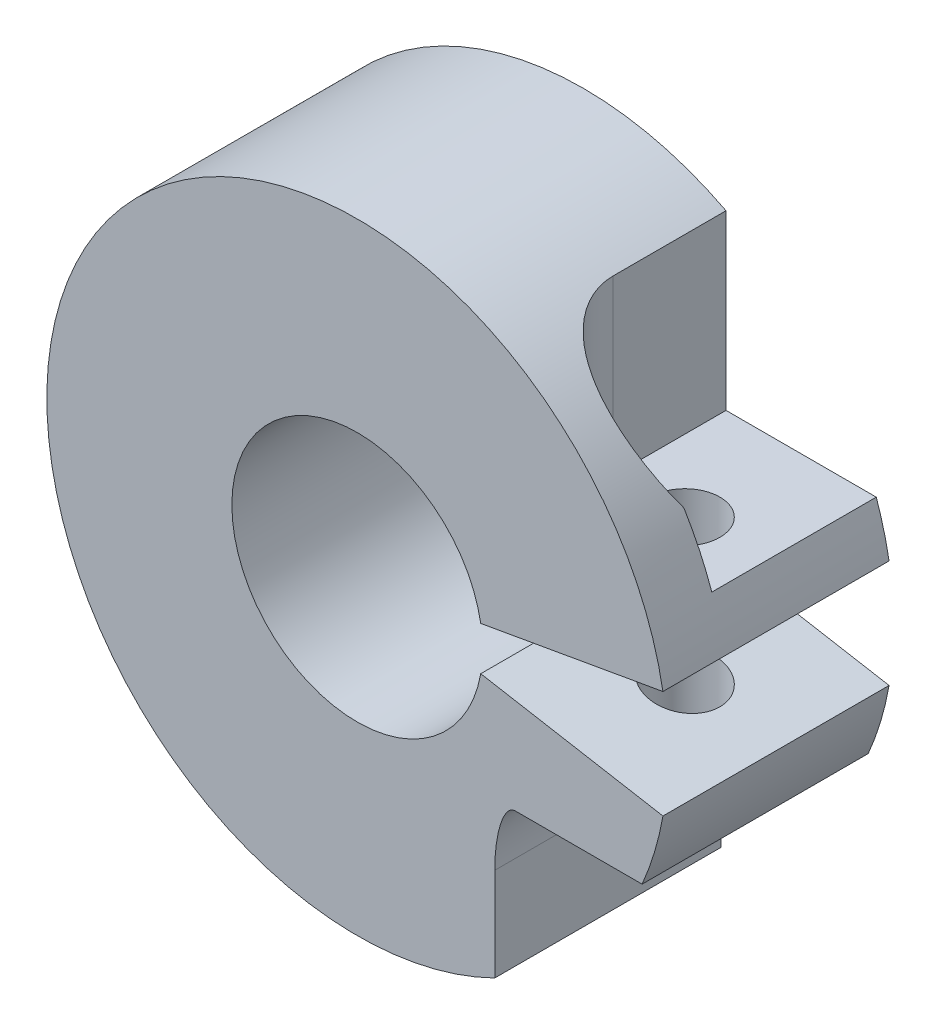
ISO-10303-21;
HEADER;
FILE_DESCRIPTION(('STEP AP214'),'2;1');
FILE_NAME('part.step','',(''),(''),'','','');
FILE_SCHEMA(('AUTOMOTIVE_DESIGN { 1 0 10303 214 1 1 1 1 }'));
ENDSEC;
DATA;
#1=APPLICATION_CONTEXT('core data for automotive mechanical design processes');
#2=APPLICATION_PROTOCOL_DEFINITION('international standard','automotive_design',2000,#1);
#3=PRODUCT_CONTEXT('',#1,'mechanical');
#4=PRODUCT('Part','Part','',(#3));
#5=PRODUCT_RELATED_PRODUCT_CATEGORY('part','',(#4));
#6=PRODUCT_DEFINITION_FORMATION('','',#4);
#7=PRODUCT_DEFINITION_CONTEXT('part definition',#1,'design');
#8=PRODUCT_DEFINITION('design','',#6,#7);
#9=PRODUCT_DEFINITION_SHAPE('','',#8);
#10=(LENGTH_UNIT() NAMED_UNIT(*) SI_UNIT(.MILLI.,.METRE.));
#11=(NAMED_UNIT(*) PLANE_ANGLE_UNIT() SI_UNIT($,.RADIAN.));
#12=(NAMED_UNIT(*) SI_UNIT($,.STERADIAN.) SOLID_ANGLE_UNIT());
#13=UNCERTAINTY_MEASURE_WITH_UNIT(LENGTH_MEASURE(1.E-05),#10,'distance_accuracy_value','');
#14=(GEOMETRIC_REPRESENTATION_CONTEXT(3) GLOBAL_UNCERTAINTY_ASSIGNED_CONTEXT((#13)) GLOBAL_UNIT_ASSIGNED_CONTEXT((#10,
#11,#12)) REPRESENTATION_CONTEXT('',''));
#15=CARTESIAN_POINT('',(0.,0.,0.));
#16=DIRECTION('',(0.,0.,1.));
#17=DIRECTION('',(1.,0.,0.));
#18=AXIS2_PLACEMENT_3D('',#15,#16,#17);
#19=CARTESIAN_POINT('',(0.,0.,11.));
#20=DIRECTION('',(0.,0.,-1.));
#21=DIRECTION('',(-1.,0.,0.));
#22=AXIS2_PLACEMENT_3D('',#19,#20,#21);
#23=CYLINDRICAL_SURFACE('',#22,15.1);
#24=CARTESIAN_POINT('',(0.,0.,0.));
#25=DIRECTION('',(0.,0.,1.));
#26=DIRECTION('',(1.,0.,0.));
#27=AXIS2_PLACEMENT_3D('',#24,#25,#26);
#28=CIRCLE('',#27,15.1);
#29=CARTESIAN_POINT('',(6.9389621819294,13.4112193270319,0.));
#30=VERTEX_POINT('',#29);
#31=CARTESIAN_POINT('',(6.6889621819294,-13.5376432560737,0.));
#32=VERTEX_POINT('',#31);
#33=EDGE_CURVE('E194',#30,#32,#28,.T.);
#34=ORIENTED_EDGE('',*,*,#33,.T.);
#35=DIRECTION('',(0.,0.,-1.));
#36=VECTOR('',#35,1.);
#37=CARTESIAN_POINT('',(6.6889621819294,-13.5376432560737,11.));
#38=LINE('',#37,#36);
#39=CARTESIAN_POINT('',(6.6889621819294,-13.5376432560737,11.));
#40=VERTEX_POINT('',#39);
#41=EDGE_CURVE('E158',#32,#40,#38,.F.);
#42=ORIENTED_EDGE('',*,*,#41,.T.);
#43=CARTESIAN_POINT('',(0.,0.,11.));
#44=DIRECTION('',(0.,0.,1.));
#45=DIRECTION('',(1.,0.,0.));
#46=AXIS2_PLACEMENT_3D('',#43,#44,#45);
#47=CIRCLE('',#46,15.1);
#48=CARTESIAN_POINT('',(14.8705970704843,2.62208748277065,11.));
#49=VERTEX_POINT('',#48);
#50=EDGE_CURVE('E166',#49,#40,#47,.T.);
#51=ORIENTED_EDGE('',*,*,#50,.F.);
#52=DIRECTION('',(0.,0.,-1.));
#53=VECTOR('',#52,1.);
#54=CARTESIAN_POINT('',(14.8705970704843,2.62208748277065,11.));
#55=LINE('',#54,#53);
#56=CARTESIAN_POINT('',(14.8705970704843,2.62208748277065,0.));
#57=VERTEX_POINT('',#56);
#58=EDGE_CURVE('E202',#49,#57,#55,.T.);
#59=ORIENTED_EDGE('',*,*,#58,.T.);
#60=CARTESIAN_POINT('',(14.2481577756565,5.,0.));
#61=VERTEX_POINT('',#60);
#62=EDGE_CURVE('E189',#57,#61,#28,.T.);
#63=ORIENTED_EDGE('',*,*,#62,.T.);
#64=DIRECTION('',(0.,0.,-1.));
#65=VECTOR('',#64,1.);
#66=CARTESIAN_POINT('',(14.2481577756565,5.,11.));
#67=LINE('',#66,#65);
#68=CARTESIAN_POINT('',(14.2481577756565,5.,8.));
#69=VERTEX_POINT('',#68);
#70=EDGE_CURVE('E358',#69,#61,#67,.T.);
#71=ORIENTED_EDGE('',*,*,#70,.F.);
#72=CARTESIAN_POINT('',(0.,0.,8.00000000000001));
#73=DIRECTION('',(0.,0.,1.));
#74=DIRECTION('',(1.,0.,0.));
#75=AXIS2_PLACEMENT_3D('',#72,#73,#74);
#76=CIRCLE('',#75,15.1);
#77=CARTESIAN_POINT('',(12.8884519247126,7.86751593480258,8.));
#78=VERTEX_POINT('',#77);
#79=EDGE_CURVE('E219',#69,#78,#76,.T.);
#80=ORIENTED_EDGE('',*,*,#79,.T.);
#81=CARTESIAN_POINT('',(6.9389621819294,13.4112193270319,5.5));
#82=CARTESIAN_POINT('',(6.9389484513675,13.4112195447243,5.58924999652139));
#83=CARTESIAN_POINT('',(6.9423757267014,13.4094529834948,5.67849416502968));
#84=CARTESIAN_POINT('',(6.95600807768608,13.4023900647413,5.85630821640909));
#85=CARTESIAN_POINT('',(6.96621202045145,13.3970942972097,5.94487820948228));
#86=CARTESIAN_POINT('',(6.99325851560519,13.3829949935007,6.12048401680907));
#87=CARTESIAN_POINT('',(7.01008381882675,13.3742005709519,6.20752320831468));
#88=CARTESIAN_POINT('',(7.05015303315526,13.3531213987343,6.379655732637));
#89=CARTESIAN_POINT('',(7.07339699447195,13.3408366217622,6.46474905022654));
#90=CARTESIAN_POINT('',(7.15237983680038,13.2987618992325,6.71620247749444));
#91=CARTESIAN_POINT('',(7.217396572924,13.2637379852567,6.8789072122984));
#92=CARTESIAN_POINT('',(7.36909464868571,13.1800566331543,7.18994746689632));
#93=CARTESIAN_POINT('',(7.45578011436167,13.1313965983003,7.33828024258971));
#94=CARTESIAN_POINT('',(7.64950465847406,13.0195188355864,7.62109476473803));
#95=CARTESIAN_POINT('',(7.75701309309699,12.9559564417325,7.75511779511494));
#96=CARTESIAN_POINT('',(7.98628566294028,12.8158992203683,8.00257281061084));
#97=CARTESIAN_POINT('',(8.10805481840316,12.7393998343781,8.11599750838199));
#98=CARTESIAN_POINT('',(8.37303946606088,12.5669969804962,8.33084689220787));
#99=CARTESIAN_POINT('',(8.51719663962771,12.4699521523716,8.43018459181593));
#100=CARTESIAN_POINT('',(8.81179268779963,12.2635500033635,8.6034760005425));
#101=CARTESIAN_POINT('',(8.96223465372188,12.154186577351,8.67741704885586));
#102=CARTESIAN_POINT('',(9.22247099039008,11.9572058378946,8.78390295401551));
#103=CARTESIAN_POINT('',(9.33184936319642,11.8720761282391,8.82224176534463));
#104=CARTESIAN_POINT('',(9.55032157621495,11.6970481788694,8.88722678799494));
#105=CARTESIAN_POINT('',(9.65941530759329,11.6071483349366,8.91386903741164));
#106=CARTESIAN_POINT('',(9.87638905374758,11.4231002098596,8.95626298044255));
#107=CARTESIAN_POINT('',(9.98426690124502,11.3289454985226,8.97199756073089));
#108=CARTESIAN_POINT('',(10.1978514212074,11.1370755115648,8.99333473247951));
#109=CARTESIAN_POINT('',(10.3035575216853,11.0393593162641,8.9989346876981));
#110=CARTESIAN_POINT('',(10.5481654856095,10.8066494467967,9.00110894357342));
#111=CARTESIAN_POINT('',(10.6859376947487,10.6704261100018,8.99390268881406));
#112=CARTESIAN_POINT('',(10.9553619363254,10.3936226533899,8.96434839975531));
#113=CARTESIAN_POINT('',(11.0870116290945,10.2530409016929,8.94199462694998));
#114=CARTESIAN_POINT('',(11.3436795460359,9.96833623986629,8.88361269187177));
#115=CARTESIAN_POINT('',(11.4686872825025,9.82420822609415,8.84756359555258));
#116=CARTESIAN_POINT('',(11.7114149803872,9.53355143464644,8.76303221124716));
#117=CARTESIAN_POINT('',(11.8291362833521,9.38702310522724,8.71455222048769));
#118=CARTESIAN_POINT('',(12.03130213163,9.12570879869751,8.6183321173353));
#119=CARTESIAN_POINT('',(12.1172564430532,9.01122975276712,8.57289888213371));
#120=CARTESIAN_POINT('',(12.2845768786763,8.78176129823346,8.47541209381099));
#121=CARTESIAN_POINT('',(12.3659436003598,8.66677195820448,8.4233594056896));
#122=CARTESIAN_POINT('',(12.5235299533566,8.43744118430534,8.31314416888982));
#123=CARTESIAN_POINT('',(12.5997790536668,8.32310028593413,8.25502262520672));
#124=CARTESIAN_POINT('',(12.747624616099,8.09485108471857,8.13234730153382));
#125=CARTESIAN_POINT('',(12.8192207896106,7.98094280912065,8.06779312317036));
#126=CARTESIAN_POINT('',(12.8884519247126,7.86751593480258,8.));
#127=B_SPLINE_CURVE_WITH_KNOTS('',3,(#81,#82,#83,#84,#85,#86,#87,#88,#89,#90,#91,#92,#93,#94,
#95,#96,#97,#98,#99,#100,#101,#102,#103,#104,#105,#106,#107,#108,#109,#110,#111,#112,#113,#114,
#115,#116,#117,#118,#119,#120,#121,#122,#123,#124,#125,#126),.UNSPECIFIED.,.F.,.F.,(4,2,2,2,2,2,
2,2,2,2,2,2,2,2,2,2,2,2,2,2,2,2,4),(0.,0.267656681662357,0.535268629235359,0.802187993021052,
1.06910944483428,1.60243763509126,2.13586745617045,2.68312478259433,3.23057534398822,
3.82877281612181,4.4272680718566,4.85814795147117,5.28917366798336,5.72087411072246,
6.15268683222946,6.73348063515818,7.31449458988881,7.89640025281596,8.47819845710031,
8.92856727821362,9.37887730755463,9.82632065407159,10.2737917280388),.UNSPECIFIED.);
#128=CARTESIAN_POINT('',(6.9389621819294,13.4112193270319,5.5));
#129=VERTEX_POINT('',#128);
#130=EDGE_CURVE('E223',#129,#78,#127,.T.);
#131=ORIENTED_EDGE('',*,*,#130,.F.);
#132=DIRECTION('',(0.,0.,-1.));
#133=VECTOR('',#132,1.);
#134=CARTESIAN_POINT('',(6.9389621819294,13.4112193270319,11.));
#135=LINE('',#134,#133);
#136=EDGE_CURVE('E215',#129,#30,#135,.T.);
#137=ORIENTED_EDGE('',*,*,#136,.T.);
#138=EDGE_LOOP('',(#34,#42,#51,#59,#63,#71,#80,#131,#137));
#139=FACE_BOUND('',#138,.T.);
#140=ADVANCED_FACE('F50',(#139),#23,.T.);
#141=CARTESIAN_POINT('',(10.4389621819294,-15.1,5.5));
#142=DIRECTION('',(0.,1.,0.));
#143=DIRECTION('',(0.,0.,1.));
#144=AXIS2_PLACEMENT_3D('',#141,#142,#143);
#145=CYLINDRICAL_SURFACE('',#144,1.7);
#146=CARTESIAN_POINT('',(10.4389621819294,1.84067068326946,5.5));
#147=DIRECTION('',(-0.173648177666931,0.984807753012208,0.));
#148=DIRECTION('',(0.984807753012208,0.173648177666931,0.));
#149=AXIS2_PLACEMENT_3D('',#146,#147,#148);
#150=ELLIPSE('',#149,1.72622524020577,1.7);
#151=CARTESIAN_POINT('',(12.1389621819294,2.14042655047386,5.5));
#152=VERTEX_POINT('',#151);
#153=EDGE_CURVE('E185',#152,#152,#150,.T.);
#154=ORIENTED_EDGE('',*,*,#153,.F.);
#155=EDGE_LOOP('',(#154));
#156=FACE_BOUND('',#155,.T.);
#157=CARTESIAN_POINT('',(10.4389621819294,5.,5.5));
#158=DIRECTION('',(0.,1.,0.));
#159=DIRECTION('',(0.,0.,1.));
#160=AXIS2_PLACEMENT_3D('',#157,#158,#159);
#161=CIRCLE('',#160,1.7);
#162=CARTESIAN_POINT('',(10.4389621819294,5.,7.2));
#163=VERTEX_POINT('',#162);
#164=EDGE_CURVE('E332',#163,#163,#161,.T.);
#165=ORIENTED_EDGE('',*,*,#164,.T.);
#166=EDGE_LOOP('',(#165));
#167=FACE_BOUND('',#166,.T.);
#168=ADVANCED_FACE('F246',(#156,#167),#145,.F.);
#169=CARTESIAN_POINT('',(0.,0.,11.));
#170=DIRECTION('',(0.,0.,-1.));
#171=DIRECTION('',(-1.,0.,0.));
#172=AXIS2_PLACEMENT_3D('',#169,#170,#171);
#173=CYLINDRICAL_SURFACE('',#172,6.1);
#174=CARTESIAN_POINT('',(0.,0.,0.));
#175=DIRECTION('',(0.,0.,-1.));
#176=DIRECTION('',(1.,0.,0.));
#177=AXIS2_PLACEMENT_3D('',#174,#175,#176);
#178=CIRCLE('',#177,6.1);
#179=CARTESIAN_POINT('',(6.00732729337447,-1.05925388376828,0.));
#180=VERTEX_POINT('',#179);
#181=CARTESIAN_POINT('',(6.00732729337447,1.05925388376828,0.));
#182=VERTEX_POINT('',#181);
#183=EDGE_CURVE('E180',#180,#182,#178,.T.);
#184=ORIENTED_EDGE('',*,*,#183,.T.);
#185=DIRECTION('',(0.,0.,-1.));
#186=VECTOR('',#185,1.);
#187=CARTESIAN_POINT('',(6.00732729337447,1.05925388376828,11.));
#188=LINE('',#187,#186);
#189=CARTESIAN_POINT('',(6.00732729337447,1.05925388376828,11.));
#190=VERTEX_POINT('',#189);
#191=EDGE_CURVE('E206',#190,#182,#188,.T.);
#192=ORIENTED_EDGE('',*,*,#191,.F.);
#193=CARTESIAN_POINT('',(0.,0.,11.));
#194=DIRECTION('',(0.,0.,-1.));
#195=DIRECTION('',(1.,0.,0.));
#196=AXIS2_PLACEMENT_3D('',#193,#194,#195);
#197=CIRCLE('',#196,6.1);
#198=CARTESIAN_POINT('',(6.00732729337447,-1.05925388376828,11.));
#199=VERTEX_POINT('',#198);
#200=EDGE_CURVE('E173',#199,#190,#197,.T.);
#201=ORIENTED_EDGE('',*,*,#200,.F.);
#202=DIRECTION('',(0.,0.,-1.));
#203=VECTOR('',#202,1.);
#204=CARTESIAN_POINT('',(6.00732729337447,-1.05925388376828,11.));
#205=LINE('',#204,#203);
#206=EDGE_CURVE('E179',#199,#180,#205,.T.);
#207=ORIENTED_EDGE('',*,*,#206,.T.);
#208=EDGE_LOOP('',(#184,#192,#201,#207));
#209=FACE_BOUND('',#208,.T.);
#210=ADVANCED_FACE('F249',(#209),#173,.F.);
#211=CARTESIAN_POINT('',(6.00732729337447,1.05925388376828,11.));
#212=DIRECTION('',(-0.173648177666931,0.984807753012208,0.));
#213=DIRECTION('',(-0.984807753012208,-0.173648177666931,0.));
#214=AXIS2_PLACEMENT_3D('',#211,#212,#213);
#215=PLANE('',#214);
#216=ORIENTED_EDGE('',*,*,#153,.T.);
#217=EDGE_LOOP('',(#216));
#218=FACE_BOUND('',#217,.T.);
#219=DIRECTION('',(0.984807753012208,0.173648177666931,0.));
#220=VECTOR('',#219,1.);
#221=CARTESIAN_POINT('',(6.00732729337447,1.05925388376828,0.));
#222=LINE('',#221,#220);
#223=EDGE_CURVE('E184',#182,#57,#222,.T.);
#224=ORIENTED_EDGE('',*,*,#223,.T.);
#225=ORIENTED_EDGE('',*,*,#58,.F.);
#226=DIRECTION('',(0.984807753012208,0.173648177666931,0.));
#227=VECTOR('',#226,1.);
#228=CARTESIAN_POINT('',(6.00732729337447,1.05925388376828,11.));
#229=LINE('',#228,#227);
#230=EDGE_CURVE('E167',#190,#49,#229,.T.);
#231=ORIENTED_EDGE('',*,*,#230,.F.);
#232=ORIENTED_EDGE('',*,*,#191,.T.);
#233=EDGE_LOOP('',(#224,#225,#231,#232));
#234=FACE_BOUND('',#233,.T.);
#235=ADVANCED_FACE('F375',(#218,#234),#215,.F.);
#236=CARTESIAN_POINT('',(13.8567672997709,-6.,11.));
#237=VERTEX_POINT('',#236);
#238=CARTESIAN_POINT('',(14.8705970704843,-2.62208748277066,11.));
#239=VERTEX_POINT('',#238);
#240=EDGE_CURVE('E147',#237,#239,#47,.T.);
#241=ORIENTED_EDGE('',*,*,#240,.F.);
#242=DIRECTION('',(0.,0.,-1.));
#243=VECTOR('',#242,1.);
#244=CARTESIAN_POINT('',(13.8567672997709,-6.,11.));
#245=LINE('',#244,#243);
#246=CARTESIAN_POINT('',(13.8567672997709,-6.,0.));
#247=VERTEX_POINT('',#246);
#248=EDGE_CURVE('E153',#237,#247,#245,.T.);
#249=ORIENTED_EDGE('',*,*,#248,.T.);
#250=CARTESIAN_POINT('',(14.8705970704843,-2.62208748277066,0.));
#251=VERTEX_POINT('',#250);
#252=EDGE_CURVE('E188',#247,#251,#28,.T.);
#253=ORIENTED_EDGE('',*,*,#252,.T.);
#254=DIRECTION('',(0.,0.,-1.));
#255=VECTOR('',#254,1.);
#256=CARTESIAN_POINT('',(14.8705970704843,-2.62208748277066,11.));
#257=LINE('',#256,#255);
#258=EDGE_CURVE('E163',#239,#251,#257,.T.);
#259=ORIENTED_EDGE('',*,*,#258,.F.);
#260=EDGE_LOOP('',(#241,#249,#253,#259));
#261=FACE_BOUND('',#260,.T.);
#262=ADVANCED_FACE('F161',(#261),#23,.T.);
#263=CARTESIAN_POINT('',(6.00732729337447,-1.05925388376828,11.));
#264=DIRECTION('',(-0.173648177666932,-0.984807753012208,0.));
#265=DIRECTION('',(0.984807753012208,-0.173648177666932,0.));
#266=AXIS2_PLACEMENT_3D('',#263,#264,#265);
#267=PLANE('',#266);
#268=CARTESIAN_POINT('',(10.4389621819294,-1.84067068326947,5.5));
#269=DIRECTION('',(-0.173648177666932,-0.984807753012208,0.));
#270=DIRECTION('',(-0.984807753012208,0.173648177666932,0.));
#271=AXIS2_PLACEMENT_3D('',#268,#269,#270);
#272=ELLIPSE('',#271,1.72622524020577,1.7);
#273=CARTESIAN_POINT('',(8.7389621819294,-1.54091481606508,5.5));
#274=VERTEX_POINT('',#273);
#275=EDGE_CURVE('E211',#274,#274,#272,.T.);
#276=ORIENTED_EDGE('',*,*,#275,.T.);
#277=EDGE_LOOP('',(#276));
#278=FACE_BOUND('',#277,.T.);
#279=DIRECTION('',(-0.984807753012208,0.173648177666932,0.));
#280=VECTOR('',#279,1.);
#281=CARTESIAN_POINT('',(6.00732729337447,-1.05925388376828,0.));
#282=LINE('',#281,#280);
#283=EDGE_CURVE('E193',#251,#180,#282,.T.);
#284=ORIENTED_EDGE('',*,*,#283,.T.);
#285=ORIENTED_EDGE('',*,*,#206,.F.);
#286=DIRECTION('',(-0.984807753012208,0.173648177666932,0.));
#287=VECTOR('',#286,1.);
#288=CARTESIAN_POINT('',(6.00732729337447,-1.05925388376828,11.));
#289=LINE('',#288,#287);
#290=EDGE_CURVE('E172',#239,#199,#289,.T.);
#291=ORIENTED_EDGE('',*,*,#290,.F.);
#292=ORIENTED_EDGE('',*,*,#258,.T.);
#293=EDGE_LOOP('',(#284,#285,#291,#292));
#294=FACE_BOUND('',#293,.T.);
#295=ADVANCED_FACE('F255',(#278,#294),#267,.F.);
#296=CARTESIAN_POINT('',(0.,0.,11.));
#297=DIRECTION('',(0.,0.,1.));
#298=DIRECTION('',(1.,0.,0.));
#299=AXIS2_PLACEMENT_3D('',#296,#297,#298);
#300=PLANE('',#299);
#301=DIRECTION('',(0.,1.,0.));
#302=VECTOR('',#301,1.);
#303=CARTESIAN_POINT('',(6.6889621819294,-15.1,11.));
#304=LINE('',#303,#302);
#305=CARTESIAN_POINT('',(6.6889621819294,-9.,11.));
#306=VERTEX_POINT('',#305);
#307=EDGE_CURVE('E320',#40,#306,#304,.T.);
#308=ORIENTED_EDGE('',*,*,#307,.T.);
#309=CARTESIAN_POINT('',(7.6889621819294,-6.,11.));
#310=CARTESIAN_POINT('',(6.6889621819294,-6.,11.));
#311=CARTESIAN_POINT('',(6.6889621819294,-9.,11.));
#312=(BOUNDED_CURVE() B_SPLINE_CURVE(2,(#309,#310,#311),.UNSPECIFIED.,.F.,
.F.) B_SPLINE_CURVE_WITH_KNOTS((3,3),(0.,1.),
.UNSPECIFIED.) CURVE() GEOMETRIC_REPRESENTATION_ITEM() RATIONAL_B_SPLINE_CURVE((1.,
0.707106781186548,1.)) REPRESENTATION_ITEM(''));
#313=CARTESIAN_POINT('',(7.6889621819294,-6.,11.));
#314=VERTEX_POINT('',#313);
#315=EDGE_CURVE('E65',#306,#314,#312,.F.);
#316=ORIENTED_EDGE('',*,*,#315,.T.);
#317=DIRECTION('',(1.,0.,0.));
#318=VECTOR('',#317,1.);
#319=CARTESIAN_POINT('',(14.8705970704843,-6.,11.));
#320=LINE('',#319,#318);
#321=EDGE_CURVE('E143',#314,#237,#320,.T.);
#322=ORIENTED_EDGE('',*,*,#321,.T.);
#323=ORIENTED_EDGE('',*,*,#240,.T.);
#324=ORIENTED_EDGE('',*,*,#290,.T.);
#325=ORIENTED_EDGE('',*,*,#200,.T.);
#326=ORIENTED_EDGE('',*,*,#230,.T.);
#327=ORIENTED_EDGE('',*,*,#50,.T.);
#328=EDGE_LOOP('',(#308,#316,#322,#323,#324,#325,#326,#327));
#329=FACE_BOUND('',#328,.T.);
#330=ADVANCED_FACE('F145',(#329),#300,.T.);
#331=CARTESIAN_POINT('',(0.,0.,0.));
#332=DIRECTION('',(0.,0.,1.));
#333=DIRECTION('',(1.,0.,0.));
#334=AXIS2_PLACEMENT_3D('',#331,#332,#333);
#335=PLANE('',#334);
#336=DIRECTION('',(-1.,0.,0.));
#337=VECTOR('',#336,1.);
#338=CARTESIAN_POINT('',(6.6889621819294,-6.,0.));
#339=LINE('',#338,#337);
#340=CARTESIAN_POINT('',(7.6889621819294,-6.,0.));
#341=VERTEX_POINT('',#340);
#342=EDGE_CURVE('E150',#247,#341,#339,.T.);
#343=ORIENTED_EDGE('',*,*,#342,.T.);
#344=CARTESIAN_POINT('',(6.6889621819294,-9.,0.));
#345=CARTESIAN_POINT('',(6.6889621819294,-6.,0.));
#346=CARTESIAN_POINT('',(7.6889621819294,-6.,0.));
#347=(BOUNDED_CURVE() B_SPLINE_CURVE(2,(#344,#345,#346),.UNSPECIFIED.,.F.,
.F.) B_SPLINE_CURVE_WITH_KNOTS((3,3),(0.,1.),
.UNSPECIFIED.) CURVE() GEOMETRIC_REPRESENTATION_ITEM() RATIONAL_B_SPLINE_CURVE((1.,
0.707106781186548,1.)) REPRESENTATION_ITEM(''));
#348=CARTESIAN_POINT('',(6.6889621819294,-9.,0.));
#349=VERTEX_POINT('',#348);
#350=EDGE_CURVE('E12',#341,#349,#347,.F.);
#351=ORIENTED_EDGE('',*,*,#350,.T.);
#352=DIRECTION('',(0.,-1.,0.));
#353=VECTOR('',#352,1.);
#354=CARTESIAN_POINT('',(6.6889621819294,0.,0.));
#355=LINE('',#354,#353);
#356=EDGE_CURVE('E232',#349,#32,#355,.T.);
#357=ORIENTED_EDGE('',*,*,#356,.T.);
#358=ORIENTED_EDGE('',*,*,#33,.F.);
#359=DIRECTION('',(0.,-1.,0.));
#360=VECTOR('',#359,1.);
#361=CARTESIAN_POINT('',(6.9389621819294,0.,0.));
#362=LINE('',#361,#360);
#363=CARTESIAN_POINT('',(6.9389621819294,5.,0.));
#364=VERTEX_POINT('',#363);
#365=EDGE_CURVE('E210',#30,#364,#362,.T.);
#366=ORIENTED_EDGE('',*,*,#365,.T.);
#367=DIRECTION('',(1.,0.,0.));
#368=VECTOR('',#367,1.);
#369=CARTESIAN_POINT('',(0.,5.,0.));
#370=LINE('',#369,#368);
#371=EDGE_CURVE('E344',#364,#61,#370,.T.);
#372=ORIENTED_EDGE('',*,*,#371,.T.);
#373=ORIENTED_EDGE('',*,*,#62,.F.);
#374=ORIENTED_EDGE('',*,*,#223,.F.);
#375=ORIENTED_EDGE('',*,*,#183,.F.);
#376=ORIENTED_EDGE('',*,*,#283,.F.);
#377=ORIENTED_EDGE('',*,*,#252,.F.);
#378=EDGE_LOOP('',(#343,#351,#357,#358,#366,#372,#373,#374,#375,#376,#377));
#379=FACE_BOUND('',#378,.T.);
#380=ADVANCED_FACE('F254',(#379),#335,.F.);
#381=CARTESIAN_POINT('',(10.4389621819294,-6.,5.5));
#382=DIRECTION('',(0.,1.,0.));
#383=DIRECTION('',(0.,0.,1.));
#384=AXIS2_PLACEMENT_3D('',#381,#382,#383);
#385=CIRCLE('',#384,1.7);
#386=CARTESIAN_POINT('',(10.4389621819294,-6.,7.2));
#387=VERTEX_POINT('',#386);
#388=EDGE_CURVE('E159',#387,#387,#385,.F.);
#389=ORIENTED_EDGE('',*,*,#388,.T.);
#390=EDGE_LOOP('',(#389));
#391=FACE_BOUND('',#390,.T.);
#392=ORIENTED_EDGE('',*,*,#275,.F.);
#393=EDGE_LOOP('',(#392));
#394=FACE_BOUND('',#393,.T.);
#395=ADVANCED_FACE('F243',(#391,#394),#145,.F.);
#396=CARTESIAN_POINT('',(10.4389621819294,15.1,5.5));
#397=DIRECTION('',(0.,-1.,0.));
#398=DIRECTION('',(0.,0.,-1.));
#399=AXIS2_PLACEMENT_3D('',#396,#397,#398);
#400=CYLINDRICAL_SURFACE('',#399,3.5);
#401=ORIENTED_EDGE('',*,*,#130,.T.);
#402=DIRECTION('',(0.,-1.,0.));
#403=VECTOR('',#402,1.);
#404=CARTESIAN_POINT('',(12.8884519247126,15.1,8.));
#405=LINE('',#404,#403);
#406=CARTESIAN_POINT('',(12.8884519247126,5.,8.));
#407=VERTEX_POINT('',#406);
#408=EDGE_CURVE('E355',#78,#407,#405,.T.);
#409=ORIENTED_EDGE('',*,*,#408,.T.);
#410=CARTESIAN_POINT('',(10.4389621819294,5.,5.5));
#411=DIRECTION('',(0.,1.,0.));
#412=DIRECTION('',(0.,0.,1.));
#413=AXIS2_PLACEMENT_3D('',#410,#411,#412);
#414=CIRCLE('',#413,3.5);
#415=CARTESIAN_POINT('',(6.9389621819294,5.,5.5));
#416=VERTEX_POINT('',#415);
#417=EDGE_CURVE('E336',#416,#407,#414,.T.);
#418=ORIENTED_EDGE('',*,*,#417,.F.);
#419=DIRECTION('',(0.,-1.,0.));
#420=VECTOR('',#419,1.);
#421=CARTESIAN_POINT('',(6.9389621819294,15.1,5.5));
#422=LINE('',#421,#420);
#423=EDGE_CURVE('E352',#129,#416,#422,.T.);
#424=ORIENTED_EDGE('',*,*,#423,.F.);
#425=EDGE_LOOP('',(#401,#409,#418,#424));
#426=FACE_BOUND('',#425,.T.);
#427=ADVANCED_FACE('F237',(#426),#400,.F.);
#428=CARTESIAN_POINT('',(0.,15.1,8.00000000000001));
#429=DIRECTION('',(0.,0.,1.));
#430=DIRECTION('',(1.,0.,0.));
#431=AXIS2_PLACEMENT_3D('',#428,#429,#430);
#432=PLANE('',#431);
#433=DIRECTION('',(-1.,0.,0.));
#434=VECTOR('',#433,1.);
#435=CARTESIAN_POINT('',(0.,5.,8.00000000000001));
#436=LINE('',#435,#434);
#437=EDGE_CURVE('E340',#69,#407,#436,.T.);
#438=ORIENTED_EDGE('',*,*,#437,.T.);
#439=ORIENTED_EDGE('',*,*,#408,.F.);
#440=ORIENTED_EDGE('',*,*,#79,.F.);
#441=EDGE_LOOP('',(#438,#439,#440));
#442=FACE_BOUND('',#441,.T.);
#443=ADVANCED_FACE('F242',(#442),#432,.F.);
#444=CARTESIAN_POINT('',(6.9389621819294,15.1,0.));
#445=DIRECTION('',(-1.,0.,0.));
#446=DIRECTION('',(0.,0.,1.));
#447=AXIS2_PLACEMENT_3D('',#444,#445,#446);
#448=PLANE('',#447);
#449=ORIENTED_EDGE('',*,*,#423,.T.);
#450=DIRECTION('',(0.,0.,-1.));
#451=VECTOR('',#450,1.);
#452=CARTESIAN_POINT('',(6.9389621819294,5.,0.));
#453=LINE('',#452,#451);
#454=EDGE_CURVE('E348',#416,#364,#453,.T.);
#455=ORIENTED_EDGE('',*,*,#454,.T.);
#456=ORIENTED_EDGE('',*,*,#365,.F.);
#457=ORIENTED_EDGE('',*,*,#136,.F.);
#458=EDGE_LOOP('',(#449,#455,#456,#457));
#459=FACE_BOUND('',#458,.T.);
#460=ADVANCED_FACE('F396',(#459),#448,.F.);
#461=CARTESIAN_POINT('',(0.,5.,0.));
#462=DIRECTION('',(0.,1.,0.));
#463=DIRECTION('',(0.,0.,1.));
#464=AXIS2_PLACEMENT_3D('',#461,#462,#463);
#465=PLANE('',#464);
#466=ORIENTED_EDGE('',*,*,#164,.F.);
#467=EDGE_LOOP('',(#466));
#468=FACE_BOUND('',#467,.T.);
#469=ORIENTED_EDGE('',*,*,#70,.T.);
#470=ORIENTED_EDGE('',*,*,#371,.F.);
#471=ORIENTED_EDGE('',*,*,#454,.F.);
#472=ORIENTED_EDGE('',*,*,#417,.T.);
#473=ORIENTED_EDGE('',*,*,#437,.F.);
#474=EDGE_LOOP('',(#469,#470,#471,#472,#473));
#475=FACE_BOUND('',#474,.T.);
#476=ADVANCED_FACE('F389',(#468,#475),#465,.T.);
#477=CARTESIAN_POINT('',(6.6889621819294,-15.1,0.));
#478=DIRECTION('',(-1.,0.,0.));
#479=DIRECTION('',(0.,0.,1.));
#480=AXIS2_PLACEMENT_3D('',#477,#478,#479);
#481=PLANE('',#480);
#482=ORIENTED_EDGE('',*,*,#356,.F.);
#483=CARTESIAN_POINT('',(6.6889621819294,-9.,11.55));
#484=CARTESIAN_POINT('',(6.6889621819294,-9.,7.51666666666668));
#485=CARTESIAN_POINT('',(6.6889621819294,-9.,3.48333333333332));
#486=CARTESIAN_POINT('',(6.6889621819294,-9.,-0.55));
#487=(BOUNDED_CURVE() B_SPLINE_CURVE(3,(#483,#484,#485,#486),.UNSPECIFIED.,.F.,
.F.) B_SPLINE_CURVE_WITH_KNOTS((4,4),(-0.01155,0.00055),
.UNSPECIFIED.) CURVE() GEOMETRIC_REPRESENTATION_ITEM() RATIONAL_B_SPLINE_CURVE((1.,1.,1.,1.)) REPRESENTATION_ITEM(''));
#488=EDGE_CURVE('E292',#349,#306,#487,.F.);
#489=ORIENTED_EDGE('',*,*,#488,.T.);
#490=ORIENTED_EDGE('',*,*,#307,.F.);
#491=ORIENTED_EDGE('',*,*,#41,.F.);
#492=EDGE_LOOP('',(#482,#489,#490,#491));
#493=FACE_BOUND('',#492,.T.);
#494=ADVANCED_FACE('F380',(#493),#481,.F.);
#495=CARTESIAN_POINT('',(0.,-6.,0.));
#496=DIRECTION('',(0.,1.,0.));
#497=DIRECTION('',(0.,0.,1.));
#498=AXIS2_PLACEMENT_3D('',#495,#496,#497);
#499=PLANE('',#498);
#500=ORIENTED_EDGE('',*,*,#388,.F.);
#501=EDGE_LOOP('',(#500));
#502=FACE_BOUND('',#501,.T.);
#503=ORIENTED_EDGE('',*,*,#321,.F.);
#504=CARTESIAN_POINT('',(7.6889621819294,-6.,-0.55));
#505=CARTESIAN_POINT('',(7.6889621819294,-6.,3.48333333333332));
#506=CARTESIAN_POINT('',(7.6889621819294,-6.,7.51666666666668));
#507=CARTESIAN_POINT('',(7.6889621819294,-6.,11.55));
#508=(BOUNDED_CURVE() B_SPLINE_CURVE(3,(#504,#505,#506,#507),.UNSPECIFIED.,.F.,
.F.) B_SPLINE_CURVE_WITH_KNOTS((4,4),(-0.01155,0.00055),
.UNSPECIFIED.) CURVE() GEOMETRIC_REPRESENTATION_ITEM() RATIONAL_B_SPLINE_CURVE((1.,1.,1.,1.)) REPRESENTATION_ITEM(''));
#509=EDGE_CURVE('E72',#314,#341,#508,.F.);
#510=ORIENTED_EDGE('',*,*,#509,.T.);
#511=ORIENTED_EDGE('',*,*,#342,.F.);
#512=ORIENTED_EDGE('',*,*,#248,.F.);
#513=EDGE_LOOP('',(#503,#510,#511,#512));
#514=FACE_BOUND('',#513,.T.);
#515=ADVANCED_FACE('F154',(#502,#514),#499,.F.);
#516=CARTESIAN_POINT('',(7.6889621819294,-6.,11.55));
#517=CARTESIAN_POINT('',(7.6889621819294,-6.,7.51666666666668));
#518=CARTESIAN_POINT('',(7.6889621819294,-6.,3.48333333333332));
#519=CARTESIAN_POINT('',(7.6889621819294,-6.,-0.55));
#520=CARTESIAN_POINT('',(6.6889621819294,-6.,11.55));
#521=CARTESIAN_POINT('',(6.6889621819294,-6.,7.51666666666667));
#522=CARTESIAN_POINT('',(6.6889621819294,-6.,3.48333333333333));
#523=CARTESIAN_POINT('',(6.6889621819294,-6.,-0.55));
#524=CARTESIAN_POINT('',(6.6889621819294,-9.,11.55));
#525=CARTESIAN_POINT('',(6.6889621819294,-9.,7.51666666666668));
#526=CARTESIAN_POINT('',(6.6889621819294,-9.,3.48333333333332));
#527=CARTESIAN_POINT('',(6.6889621819294,-9.,-0.55));
#528=(BOUNDED_SURFACE() B_SPLINE_SURFACE(2,3,((#516,#517,#518,#519),(#520,#521,#522,#523),(#524,
#525,#526,#527)),.UNSPECIFIED.,.F.,.F.,.F.) B_SPLINE_SURFACE_WITH_KNOTS((3,3),(4,4),(0.,1.),
(-0.01155,0.00055),
.UNSPECIFIED.) GEOMETRIC_REPRESENTATION_ITEM() RATIONAL_B_SPLINE_SURFACE(((1.,1.,1.,1.),
(0.707106781186548,0.707106781186548,0.707106781186548,0.707106781186548),(1.,1.,1.,1.))) REPRESENTATION_ITEM('') SURFACE());
#529=ORIENTED_EDGE('',*,*,#350,.F.);
#530=ORIENTED_EDGE('',*,*,#509,.F.);
#531=ORIENTED_EDGE('',*,*,#315,.F.);
#532=ORIENTED_EDGE('',*,*,#488,.F.);
#533=EDGE_LOOP('',(#529,#530,#531,#532));
#534=FACE_BOUND('',#533,.T.);
#535=ADVANCED_FACE('F53',(#534),#528,.T.);
#536=CLOSED_SHELL('',(#140,#168,#210,#235,#262,#295,#330,#380,#395,#427,#443,#460,#476,#494,
#515,#535));
#537=MANIFOLD_SOLID_BREP('B2',#536);
#538=ADVANCED_BREP_SHAPE_REPRESENTATION('',(#18,#537),#14);
#539=SHAPE_DEFINITION_REPRESENTATION(#9,#538);
ENDSEC;
END-ISO-10303-21;
